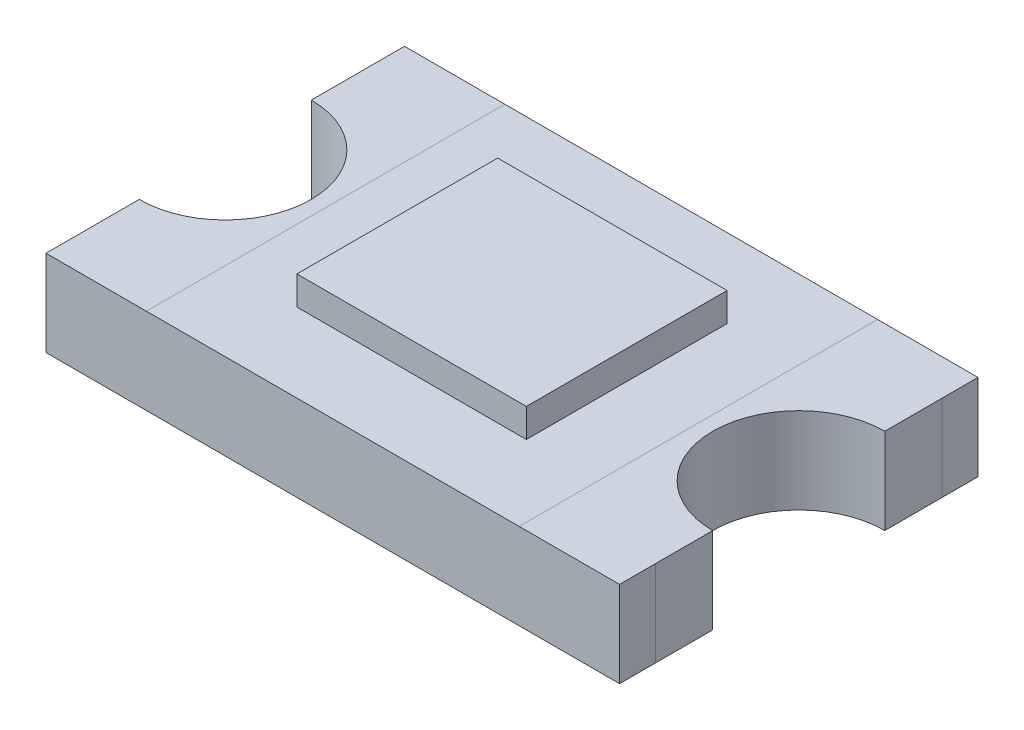
ISO-10303-21;
HEADER;
FILE_DESCRIPTION(('STEP AP214'),'2;1');
FILE_NAME('part.step','',(''),(''),'','','');
FILE_SCHEMA(('AUTOMOTIVE_DESIGN { 1 0 10303 214 1 1 1 1 }'));
ENDSEC;
DATA;
#1=APPLICATION_CONTEXT('core data for automotive mechanical design processes');
#2=APPLICATION_PROTOCOL_DEFINITION('international standard','automotive_design',2000,#1);
#3=PRODUCT_CONTEXT('',#1,'mechanical');
#4=PRODUCT('Part','Part','',(#3));
#5=PRODUCT_RELATED_PRODUCT_CATEGORY('part','',(#4));
#6=PRODUCT_DEFINITION_FORMATION('','',#4);
#7=PRODUCT_DEFINITION_CONTEXT('part definition',#1,'design');
#8=PRODUCT_DEFINITION('design','',#6,#7);
#9=PRODUCT_DEFINITION_SHAPE('','',#8);
#10=(LENGTH_UNIT() NAMED_UNIT(*) SI_UNIT(.MILLI.,.METRE.));
#11=(NAMED_UNIT(*) PLANE_ANGLE_UNIT() SI_UNIT($,.RADIAN.));
#12=(NAMED_UNIT(*) SI_UNIT($,.STERADIAN.) SOLID_ANGLE_UNIT());
#13=UNCERTAINTY_MEASURE_WITH_UNIT(LENGTH_MEASURE(1.E-05),#10,'distance_accuracy_value','');
#14=(GEOMETRIC_REPRESENTATION_CONTEXT(3) GLOBAL_UNCERTAINTY_ASSIGNED_CONTEXT((#13)) GLOBAL_UNIT_ASSIGNED_CONTEXT((#10,
#11,#12)) REPRESENTATION_CONTEXT('',''));
#15=CARTESIAN_POINT('',(0.,0.,0.));
#16=DIRECTION('',(0.,0.,1.));
#17=DIRECTION('',(1.,0.,0.));
#18=AXIS2_PLACEMENT_3D('',#15,#16,#17);
#19=CARTESIAN_POINT('',(1.,0.,0.));
#20=DIRECTION('',(0.,1.,0.));
#21=DIRECTION('',(1.,0.,0.));
#22=AXIS2_PLACEMENT_3D('',#19,#20,#21);
#23=PLANE('',#22);
#24=DIRECTION('',(0.,0.,1.));
#25=VECTOR('',#24,1.);
#26=CARTESIAN_POINT('',(-1.,0.,-0.3));
#27=LINE('',#26,#25);
#28=CARTESIAN_POINT('',(-1.,0.,-0.575));
#29=VERTEX_POINT('',#28);
#30=CARTESIAN_POINT('',(-1.,0.,-0.5));
#31=VERTEX_POINT('',#30);
#32=EDGE_CURVE('P0_E344',#29,#31,#27,.T.);
#33=ORIENTED_EDGE('',*,*,#32,.F.);
#34=DIRECTION('',(1.,0.,0.));
#35=VECTOR('',#34,1.);
#36=CARTESIAN_POINT('',(1.,0.,-0.575));
#37=LINE('',#36,#35);
#38=CARTESIAN_POINT('',(-0.6,0.,-0.575));
#39=VERTEX_POINT('',#38);
#40=EDGE_CURVE('P0_E297',#29,#39,#37,.T.);
#41=ORIENTED_EDGE('',*,*,#40,.T.);
#42=DIRECTION('',(0.,0.,1.));
#43=VECTOR('',#42,1.);
#44=CARTESIAN_POINT('',(-0.6,0.,0.));
#45=LINE('',#44,#43);
#46=CARTESIAN_POINT('',(-0.6,0.,0.575));
#47=VERTEX_POINT('',#46);
#48=EDGE_CURVE('P0_E295',#39,#47,#45,.T.);
#49=ORIENTED_EDGE('',*,*,#48,.T.);
#50=DIRECTION('',(-1.,0.,0.));
#51=VECTOR('',#50,1.);
#52=CARTESIAN_POINT('',(1.,0.,0.575));
#53=LINE('',#52,#51);
#54=CARTESIAN_POINT('',(-1.,0.,0.575));
#55=VERTEX_POINT('',#54);
#56=EDGE_CURVE('P0_E292',#47,#55,#53,.T.);
#57=ORIENTED_EDGE('',*,*,#56,.T.);
#58=DIRECTION('',(0.,0.,1.));
#59=VECTOR('',#58,1.);
#60=CARTESIAN_POINT('',(-1.,0.,0.625));
#61=LINE('',#60,#59);
#62=CARTESIAN_POINT('',(-1.,0.,0.5));
#63=VERTEX_POINT('',#62);
#64=EDGE_CURVE('P0_E377',#63,#55,#61,.T.);
#65=ORIENTED_EDGE('',*,*,#64,.F.);
#66=DIRECTION('',(0.,0.,1.));
#67=VECTOR('',#66,1.);
#68=CARTESIAN_POINT('',(-1.,0.,0.625));
#69=LINE('',#68,#67);
#70=CARTESIAN_POINT('',(-1.,0.,0.3));
#71=VERTEX_POINT('',#70);
#72=EDGE_CURVE('P0_E49',#71,#63,#69,.T.);
#73=ORIENTED_EDGE('',*,*,#72,.F.);
#74=CARTESIAN_POINT('',(-1.,0.,0.));
#75=DIRECTION('',(0.,-1.,0.));
#76=DIRECTION('',(0.,0.,1.));
#77=AXIS2_PLACEMENT_3D('',#74,#75,#76);
#78=CIRCLE('',#77,0.3);
#79=CARTESIAN_POINT('',(-1.,0.,-0.3));
#80=VERTEX_POINT('',#79);
#81=EDGE_CURVE('P0_E348',#80,#71,#78,.T.);
#82=ORIENTED_EDGE('',*,*,#81,.F.);
#83=DIRECTION('',(0.,0.,1.));
#84=VECTOR('',#83,1.);
#85=CARTESIAN_POINT('',(-1.,0.,-0.3));
#86=LINE('',#85,#84);
#87=EDGE_CURVE('P0_E367',#31,#80,#86,.T.);
#88=ORIENTED_EDGE('',*,*,#87,.F.);
#89=EDGE_LOOP('',(#33,#41,#49,#57,#65,#73,#82,#88));
#90=FACE_BOUND('',#89,.T.);
#91=ADVANCED_FACE('P0_F17',(#90),#23,.F.);
#92=CARTESIAN_POINT('',(1.,0.3,0.));
#93=DIRECTION('',(0.,1.,0.));
#94=DIRECTION('',(1.,0.,0.));
#95=AXIS2_PLACEMENT_3D('',#92,#93,#94);
#96=PLANE('',#95);
#97=DIRECTION('',(0.,0.,-1.));
#98=VECTOR('',#97,1.);
#99=CARTESIAN_POINT('',(0.65,0.3,0.));
#100=LINE('',#99,#98);
#101=CARTESIAN_POINT('',(0.65,0.3,0.625));
#102=VERTEX_POINT('',#101);
#103=CARTESIAN_POINT('',(0.65,0.3,-0.625));
#104=VERTEX_POINT('',#103);
#105=EDGE_CURVE('P0_E229',#102,#104,#100,.T.);
#106=ORIENTED_EDGE('',*,*,#105,.F.);
#107=DIRECTION('',(1.,0.,0.));
#108=VECTOR('',#107,1.);
#109=CARTESIAN_POINT('',(-1.,0.3,0.625));
#110=LINE('',#109,#108);
#111=CARTESIAN_POINT('',(1.,0.3,0.625));
#112=VERTEX_POINT('',#111);
#113=EDGE_CURVE('P0_E219',#102,#112,#110,.T.);
#114=ORIENTED_EDGE('',*,*,#113,.T.);
#115=DIRECTION('',(0.,0.,-1.));
#116=VECTOR('',#115,1.);
#117=CARTESIAN_POINT('',(1.,0.3,0.625));
#118=LINE('',#117,#116);
#119=CARTESIAN_POINT('',(1.,0.3,0.5));
#120=VERTEX_POINT('',#119);
#121=EDGE_CURVE('P0_E396',#112,#120,#118,.T.);
#122=ORIENTED_EDGE('',*,*,#121,.T.);
#123=DIRECTION('',(0.,0.,-1.));
#124=VECTOR('',#123,1.);
#125=CARTESIAN_POINT('',(1.,0.3,0.625));
#126=LINE('',#125,#124);
#127=CARTESIAN_POINT('',(1.,0.3,0.3));
#128=VERTEX_POINT('',#127);
#129=EDGE_CURVE('P0_E281',#120,#128,#126,.T.);
#130=ORIENTED_EDGE('',*,*,#129,.T.);
#131=CARTESIAN_POINT('',(1.,0.3,0.));
#132=DIRECTION('',(0.,-1.,0.));
#133=DIRECTION('',(0.,0.,1.));
#134=AXIS2_PLACEMENT_3D('',#131,#132,#133);
#135=CIRCLE('',#134,0.3);
#136=CARTESIAN_POINT('',(1.,0.3,-0.3));
#137=VERTEX_POINT('',#136);
#138=EDGE_CURVE('P0_E25',#128,#137,#135,.T.);
#139=ORIENTED_EDGE('',*,*,#138,.T.);
#140=DIRECTION('',(0.,0.,-1.));
#141=VECTOR('',#140,1.);
#142=CARTESIAN_POINT('',(1.,0.3,-0.3));
#143=LINE('',#142,#141);
#144=CARTESIAN_POINT('',(1.,0.3,-0.5));
#145=VERTEX_POINT('',#144);
#146=EDGE_CURVE('P0_E405',#137,#145,#143,.T.);
#147=ORIENTED_EDGE('',*,*,#146,.T.);
#148=DIRECTION('',(0.,0.,-1.));
#149=VECTOR('',#148,1.);
#150=CARTESIAN_POINT('',(1.,0.3,-0.3));
#151=LINE('',#150,#149);
#152=CARTESIAN_POINT('',(1.,0.3,-0.625));
#153=VERTEX_POINT('',#152);
#154=EDGE_CURVE('P0_E11',#145,#153,#151,.T.);
#155=ORIENTED_EDGE('',*,*,#154,.T.);
#156=DIRECTION('',(-1.,0.,0.));
#157=VECTOR('',#156,1.);
#158=CARTESIAN_POINT('',(-1.,0.3,-0.625));
#159=LINE('',#158,#157);
#160=EDGE_CURVE('P0_E225',#153,#104,#159,.T.);
#161=ORIENTED_EDGE('',*,*,#160,.T.);
#162=EDGE_LOOP('',(#106,#114,#122,#130,#139,#147,#155,#161));
#163=FACE_BOUND('',#162,.T.);
#164=ADVANCED_FACE('P0_F227',(#163),#96,.T.);
#165=CARTESIAN_POINT('',(1.,0.3,-0.3));
#166=DIRECTION('',(-1.,0.,0.));
#167=DIRECTION('',(0.,0.,1.));
#168=AXIS2_PLACEMENT_3D('',#165,#166,#167);
#169=PLANE('',#168);
#170=ORIENTED_EDGE('',*,*,#154,.F.);
#171=DIRECTION('',(0.,-1.,0.));
#172=VECTOR('',#171,1.);
#173=CARTESIAN_POINT('',(1.,0.3,-0.5));
#174=LINE('',#173,#172);
#175=CARTESIAN_POINT('',(1.,0.,-0.5));
#176=VERTEX_POINT('',#175);
#177=EDGE_CURVE('P0_E393',#145,#176,#174,.T.);
#178=ORIENTED_EDGE('',*,*,#177,.T.);
#179=DIRECTION('',(0.,0.,-1.));
#180=VECTOR('',#179,1.);
#181=CARTESIAN_POINT('',(1.,0.,-0.3));
#182=LINE('',#181,#180);
#183=CARTESIAN_POINT('',(1.,0.,-0.575));
#184=VERTEX_POINT('',#183);
#185=EDGE_CURVE('P0_E269',#176,#184,#182,.T.);
#186=ORIENTED_EDGE('',*,*,#185,.T.);
#187=DIRECTION('',(0.,0.,-1.));
#188=VECTOR('',#187,1.);
#189=CARTESIAN_POINT('',(1.,0.,-0.3));
#190=LINE('',#189,#188);
#191=CARTESIAN_POINT('',(1.,0.,-0.625));
#192=VERTEX_POINT('',#191);
#193=EDGE_CURVE('P0_E308',#184,#192,#190,.T.);
#194=ORIENTED_EDGE('',*,*,#193,.T.);
#195=DIRECTION('',(0.,-1.,0.));
#196=VECTOR('',#195,1.);
#197=CARTESIAN_POINT('',(1.,0.3,-0.625));
#198=LINE('',#197,#196);
#199=EDGE_CURVE('P0_E235',#153,#192,#198,.T.);
#200=ORIENTED_EDGE('',*,*,#199,.F.);
#201=EDGE_LOOP('',(#170,#178,#186,#194,#200));
#202=FACE_BOUND('',#201,.T.);
#203=ADVANCED_FACE('P0_F463',(#202),#169,.F.);
#204=CARTESIAN_POINT('',(1.,0.3,0.));
#205=DIRECTION('',(0.,-1.,0.));
#206=DIRECTION('',(0.,0.,-1.));
#207=AXIS2_PLACEMENT_3D('',#204,#205,#206);
#208=CYLINDRICAL_SURFACE('',#207,0.3);
#209=CARTESIAN_POINT('',(1.,0.,0.));
#210=DIRECTION('',(0.,-1.,0.));
#211=DIRECTION('',(0.,0.,1.));
#212=AXIS2_PLACEMENT_3D('',#209,#210,#211);
#213=CIRCLE('',#212,0.3);
#214=CARTESIAN_POINT('',(1.,0.,0.3));
#215=VERTEX_POINT('',#214);
#216=CARTESIAN_POINT('',(1.,0.,-0.3));
#217=VERTEX_POINT('',#216);
#218=EDGE_CURVE('P0_E265',#215,#217,#213,.T.);
#219=ORIENTED_EDGE('',*,*,#218,.T.);
#220=DIRECTION('',(0.,-1.,0.));
#221=VECTOR('',#220,1.);
#222=CARTESIAN_POINT('',(1.,0.3,-0.3));
#223=LINE('',#222,#221);
#224=EDGE_CURVE('P0_E408',#137,#217,#223,.T.);
#225=ORIENTED_EDGE('',*,*,#224,.F.);
#226=ORIENTED_EDGE('',*,*,#138,.F.);
#227=DIRECTION('',(0.,-1.,0.));
#228=VECTOR('',#227,1.);
#229=CARTESIAN_POINT('',(1.,0.3,0.3));
#230=LINE('',#229,#228);
#231=EDGE_CURVE('P0_E125',#128,#215,#230,.T.);
#232=ORIENTED_EDGE('',*,*,#231,.T.);
#233=EDGE_LOOP('',(#219,#225,#226,#232));
#234=FACE_BOUND('',#233,.T.);
#235=ADVANCED_FACE('P0_F469',(#234),#208,.F.);
#236=CARTESIAN_POINT('',(1.,0.3,0.625));
#237=DIRECTION('',(-1.,0.,0.));
#238=DIRECTION('',(0.,0.,1.));
#239=AXIS2_PLACEMENT_3D('',#236,#237,#238);
#240=PLANE('',#239);
#241=ORIENTED_EDGE('',*,*,#129,.F.);
#242=DIRECTION('',(0.,-1.,0.));
#243=VECTOR('',#242,1.);
#244=CARTESIAN_POINT('',(1.,0.3,0.5));
#245=LINE('',#244,#243);
#246=CARTESIAN_POINT('',(1.,0.,0.5));
#247=VERTEX_POINT('',#246);
#248=EDGE_CURVE('P0_E382',#120,#247,#245,.T.);
#249=ORIENTED_EDGE('',*,*,#248,.T.);
#250=DIRECTION('',(0.,0.,-1.));
#251=VECTOR('',#250,1.);
#252=CARTESIAN_POINT('',(1.,0.,0.625));
#253=LINE('',#252,#251);
#254=EDGE_CURVE('P0_E268',#247,#215,#253,.T.);
#255=ORIENTED_EDGE('',*,*,#254,.T.);
#256=ORIENTED_EDGE('',*,*,#231,.F.);
#257=EDGE_LOOP('',(#241,#249,#255,#256));
#258=FACE_BOUND('',#257,.T.);
#259=ADVANCED_FACE('P0_F450',(#258),#240,.F.);
#260=CARTESIAN_POINT('',(-1.,0.3,0.625));
#261=DIRECTION('',(0.,0.,-1.));
#262=DIRECTION('',(0.,-1.,0.));
#263=AXIS2_PLACEMENT_3D('',#260,#261,#262);
#264=PLANE('',#263);
#265=DIRECTION('',(1.,0.,0.));
#266=VECTOR('',#265,1.);
#267=CARTESIAN_POINT('',(-1.,0.,0.625));
#268=LINE('',#267,#266);
#269=CARTESIAN_POINT('',(-1.,0.,0.625));
#270=VERTEX_POINT('',#269);
#271=CARTESIAN_POINT('',(1.,0.,0.625));
#272=VERTEX_POINT('',#271);
#273=EDGE_CURVE('P0_E289',#270,#272,#268,.T.);
#274=ORIENTED_EDGE('',*,*,#273,.T.);
#275=DIRECTION('',(0.,-1.,0.));
#276=VECTOR('',#275,1.);
#277=CARTESIAN_POINT('',(1.,0.3,0.625));
#278=LINE('',#277,#276);
#279=EDGE_CURVE('P0_E400',#112,#272,#278,.T.);
#280=ORIENTED_EDGE('',*,*,#279,.F.);
#281=ORIENTED_EDGE('',*,*,#113,.F.);
#282=DIRECTION('',(1.,0.,0.));
#283=VECTOR('',#282,1.);
#284=CARTESIAN_POINT('',(-1.,0.3,0.625));
#285=LINE('',#284,#283);
#286=CARTESIAN_POINT('',(-0.65,0.3,0.625));
#287=VERTEX_POINT('',#286);
#288=EDGE_CURVE('P0_E251',#287,#102,#285,.T.);
#289=ORIENTED_EDGE('',*,*,#288,.F.);
#290=DIRECTION('',(1.,0.,0.));
#291=VECTOR('',#290,1.);
#292=CARTESIAN_POINT('',(-1.,0.3,0.625));
#293=LINE('',#292,#291);
#294=CARTESIAN_POINT('',(-1.,0.3,0.625));
#295=VERTEX_POINT('',#294);
#296=EDGE_CURVE('P0_E270',#295,#287,#293,.T.);
#297=ORIENTED_EDGE('',*,*,#296,.F.);
#298=DIRECTION('',(0.,-1.,0.));
#299=VECTOR('',#298,1.);
#300=CARTESIAN_POINT('',(-1.,0.3,0.625));
#301=LINE('',#300,#299);
#302=EDGE_CURVE('P0_E376',#295,#270,#301,.T.);
#303=ORIENTED_EDGE('',*,*,#302,.T.);
#304=EDGE_LOOP('',(#274,#280,#281,#289,#297,#303));
#305=FACE_BOUND('',#304,.T.);
#306=ADVANCED_FACE('P0_F452',(#305),#264,.F.);
#307=CARTESIAN_POINT('',(-1.,0.3,0.625));
#308=DIRECTION('',(1.,0.,0.));
#309=DIRECTION('',(0.,1.,0.));
#310=AXIS2_PLACEMENT_3D('',#307,#308,#309);
#311=PLANE('',#310);
#312=ORIENTED_EDGE('',*,*,#72,.T.);
#313=DIRECTION('',(0.,1.,0.));
#314=VECTOR('',#313,1.);
#315=CARTESIAN_POINT('',(-1.,0.3,0.5));
#316=LINE('',#315,#314);
#317=CARTESIAN_POINT('',(-1.,0.3,0.5));
#318=VERTEX_POINT('',#317);
#319=EDGE_CURVE('P0_E362',#63,#318,#316,.T.);
#320=ORIENTED_EDGE('',*,*,#319,.T.);
#321=DIRECTION('',(0.,0.,1.));
#322=VECTOR('',#321,1.);
#323=CARTESIAN_POINT('',(-1.,0.3,0.625));
#324=LINE('',#323,#322);
#325=CARTESIAN_POINT('',(-1.,0.3,0.3));
#326=VERTEX_POINT('',#325);
#327=EDGE_CURVE('P0_E285',#326,#318,#324,.T.);
#328=ORIENTED_EDGE('',*,*,#327,.F.);
#329=DIRECTION('',(0.,-1.,0.));
#330=VECTOR('',#329,1.);
#331=CARTESIAN_POINT('',(-1.,0.3,0.3));
#332=LINE('',#331,#330);
#333=EDGE_CURVE('P0_E263',#326,#71,#332,.T.);
#334=ORIENTED_EDGE('',*,*,#333,.T.);
#335=EDGE_LOOP('',(#312,#320,#328,#334));
#336=FACE_BOUND('',#335,.T.);
#337=ADVANCED_FACE('P0_F706',(#336),#311,.F.);
#338=CARTESIAN_POINT('',(-1.,0.3,0.));
#339=DIRECTION('',(0.,-1.,0.));
#340=DIRECTION('',(0.,0.,-1.));
#341=AXIS2_PLACEMENT_3D('',#338,#339,#340);
#342=CYLINDRICAL_SURFACE('',#341,0.3);
#343=ORIENTED_EDGE('',*,*,#81,.T.);
#344=ORIENTED_EDGE('',*,*,#333,.F.);
#345=CARTESIAN_POINT('',(-1.,0.3,0.));
#346=DIRECTION('',(0.,-1.,0.));
#347=DIRECTION('',(0.,0.,1.));
#348=AXIS2_PLACEMENT_3D('',#345,#346,#347);
#349=CIRCLE('',#348,0.3);
#350=CARTESIAN_POINT('',(-1.,0.3,-0.3));
#351=VERTEX_POINT('',#350);
#352=EDGE_CURVE('P0_E280',#351,#326,#349,.T.);
#353=ORIENTED_EDGE('',*,*,#352,.F.);
#354=DIRECTION('',(0.,-1.,0.));
#355=VECTOR('',#354,1.);
#356=CARTESIAN_POINT('',(-1.,0.3,-0.3));
#357=LINE('',#356,#355);
#358=EDGE_CURVE('P0_E371',#351,#80,#357,.T.);
#359=ORIENTED_EDGE('',*,*,#358,.T.);
#360=EDGE_LOOP('',(#343,#344,#353,#359));
#361=FACE_BOUND('',#360,.T.);
#362=ADVANCED_FACE('P0_F678',(#361),#342,.F.);
#363=CARTESIAN_POINT('',(-1.,0.3,-0.3));
#364=DIRECTION('',(1.,0.,0.));
#365=DIRECTION('',(0.,1.,0.));
#366=AXIS2_PLACEMENT_3D('',#363,#364,#365);
#367=PLANE('',#366);
#368=ORIENTED_EDGE('',*,*,#32,.T.);
#369=DIRECTION('',(0.,1.,0.));
#370=VECTOR('',#369,1.);
#371=CARTESIAN_POINT('',(-1.,0.3,-0.5));
#372=LINE('',#371,#370);
#373=CARTESIAN_POINT('',(-1.,0.3,-0.5));
#374=VERTEX_POINT('',#373);
#375=EDGE_CURVE('P0_E363',#31,#374,#372,.T.);
#376=ORIENTED_EDGE('',*,*,#375,.T.);
#377=DIRECTION('',(0.,0.,1.));
#378=VECTOR('',#377,1.);
#379=CARTESIAN_POINT('',(-1.,0.3,-0.3));
#380=LINE('',#379,#378);
#381=CARTESIAN_POINT('',(-1.,0.3,-0.625));
#382=VERTEX_POINT('',#381);
#383=EDGE_CURVE('P0_E275',#382,#374,#380,.T.);
#384=ORIENTED_EDGE('',*,*,#383,.F.);
#385=DIRECTION('',(0.,-1.,0.));
#386=VECTOR('',#385,1.);
#387=CARTESIAN_POINT('',(-1.,0.3,-0.625));
#388=LINE('',#387,#386);
#389=CARTESIAN_POINT('',(-1.,0.,-0.625));
#390=VERTEX_POINT('',#389);
#391=EDGE_CURVE('P0_E236',#382,#390,#388,.T.);
#392=ORIENTED_EDGE('',*,*,#391,.T.);
#393=DIRECTION('',(0.,0.,1.));
#394=VECTOR('',#393,1.);
#395=CARTESIAN_POINT('',(-1.,0.,-0.3));
#396=LINE('',#395,#394);
#397=EDGE_CURVE('P0_E301',#390,#29,#396,.T.);
#398=ORIENTED_EDGE('',*,*,#397,.T.);
#399=EDGE_LOOP('',(#368,#376,#384,#392,#398));
#400=FACE_BOUND('',#399,.T.);
#401=ADVANCED_FACE('P0_F490',(#400),#367,.F.);
#402=CARTESIAN_POINT('',(-1.,0.3,-0.625));
#403=DIRECTION('',(0.,0.,1.));
#404=DIRECTION('',(1.,0.,0.));
#405=AXIS2_PLACEMENT_3D('',#402,#403,#404);
#406=PLANE('',#405);
#407=DIRECTION('',(-1.,0.,0.));
#408=VECTOR('',#407,1.);
#409=CARTESIAN_POINT('',(-1.,0.,-0.625));
#410=LINE('',#409,#408);
#411=EDGE_CURVE('P0_E305',#192,#390,#410,.T.);
#412=ORIENTED_EDGE('',*,*,#411,.T.);
#413=ORIENTED_EDGE('',*,*,#391,.F.);
#414=DIRECTION('',(-1.,0.,0.));
#415=VECTOR('',#414,1.);
#416=CARTESIAN_POINT('',(-1.,0.3,-0.625));
#417=LINE('',#416,#415);
#418=CARTESIAN_POINT('',(-0.65,0.3,-0.625));
#419=VERTEX_POINT('',#418);
#420=EDGE_CURVE('P0_E243',#419,#382,#417,.T.);
#421=ORIENTED_EDGE('',*,*,#420,.F.);
#422=DIRECTION('',(-1.,0.,0.));
#423=VECTOR('',#422,1.);
#424=CARTESIAN_POINT('',(-1.,0.3,-0.625));
#425=LINE('',#424,#423);
#426=EDGE_CURVE('P0_E239',#104,#419,#425,.T.);
#427=ORIENTED_EDGE('',*,*,#426,.F.);
#428=ORIENTED_EDGE('',*,*,#160,.F.);
#429=ORIENTED_EDGE('',*,*,#199,.T.);
#430=EDGE_LOOP('',(#412,#413,#421,#427,#428,#429));
#431=FACE_BOUND('',#430,.T.);
#432=ADVANCED_FACE('P0_F241',(#431),#406,.F.);
#433=CARTESIAN_POINT('',(1.,0.,0.));
#434=DIRECTION('',(0.,1.,0.));
#435=DIRECTION('',(1.,0.,0.));
#436=AXIS2_PLACEMENT_3D('',#433,#434,#435);
#437=PLANE('',#436);
#438=DIRECTION('',(0.,0.,-1.));
#439=VECTOR('',#438,1.);
#440=CARTESIAN_POINT('',(1.,0.,0.625));
#441=LINE('',#440,#439);
#442=CARTESIAN_POINT('',(1.,0.,0.575));
#443=VERTEX_POINT('',#442);
#444=EDGE_CURVE('P0_E258',#443,#247,#441,.T.);
#445=ORIENTED_EDGE('',*,*,#444,.F.);
#446=DIRECTION('',(-1.,0.,0.));
#447=VECTOR('',#446,1.);
#448=CARTESIAN_POINT('',(1.,0.,0.575));
#449=LINE('',#448,#447);
#450=CARTESIAN_POINT('',(0.6,0.,0.575));
#451=VERTEX_POINT('',#450);
#452=EDGE_CURVE('P0_E288',#443,#451,#449,.T.);
#453=ORIENTED_EDGE('',*,*,#452,.T.);
#454=DIRECTION('',(0.,0.,-1.));
#455=VECTOR('',#454,1.);
#456=CARTESIAN_POINT('',(0.6,0.,0.));
#457=LINE('',#456,#455);
#458=CARTESIAN_POINT('',(0.6,0.,-0.575));
#459=VERTEX_POINT('',#458);
#460=EDGE_CURVE('P0_E316',#451,#459,#457,.T.);
#461=ORIENTED_EDGE('',*,*,#460,.T.);
#462=DIRECTION('',(1.,0.,0.));
#463=VECTOR('',#462,1.);
#464=CARTESIAN_POINT('',(1.,0.,-0.575));
#465=LINE('',#464,#463);
#466=EDGE_CURVE('P0_E312',#459,#184,#465,.T.);
#467=ORIENTED_EDGE('',*,*,#466,.T.);
#468=ORIENTED_EDGE('',*,*,#185,.F.);
#469=DIRECTION('',(0.,0.,-1.));
#470=VECTOR('',#469,1.);
#471=CARTESIAN_POINT('',(1.,0.,-0.3));
#472=LINE('',#471,#470);
#473=EDGE_CURVE('P0_E422',#217,#176,#472,.T.);
#474=ORIENTED_EDGE('',*,*,#473,.F.);
#475=ORIENTED_EDGE('',*,*,#218,.F.);
#476=ORIENTED_EDGE('',*,*,#254,.F.);
#477=EDGE_LOOP('',(#445,#453,#461,#467,#468,#474,#475,#476));
#478=FACE_BOUND('',#477,.T.);
#479=ADVANCED_FACE('P0_F458',(#478),#437,.F.);
#480=CARTESIAN_POINT('',(1.,0.,0.));
#481=DIRECTION('',(0.,1.,0.));
#482=DIRECTION('',(1.,0.,0.));
#483=AXIS2_PLACEMENT_3D('',#480,#481,#482);
#484=PLANE('',#483);
#485=DIRECTION('',(0.,0.,1.));
#486=VECTOR('',#485,1.);
#487=CARTESIAN_POINT('',(-0.0375,0.,0.));
#488=LINE('',#487,#486);
#489=CARTESIAN_POINT('',(-0.0375,0.,0.0625));
#490=VERTEX_POINT('',#489);
#491=CARTESIAN_POINT('',(-0.0375,0.,0.525));
#492=VERTEX_POINT('',#491);
#493=EDGE_CURVE('P0_E322',#490,#492,#488,.T.);
#494=ORIENTED_EDGE('',*,*,#493,.T.);
#495=DIRECTION('',(-1.,0.,0.));
#496=VECTOR('',#495,1.);
#497=CARTESIAN_POINT('',(1.,0.,0.525));
#498=LINE('',#497,#496);
#499=CARTESIAN_POINT('',(-0.1625,0.,0.525));
#500=VERTEX_POINT('',#499);
#501=EDGE_CURVE('P0_E319',#492,#500,#498,.T.);
#502=ORIENTED_EDGE('',*,*,#501,.T.);
#503=DIRECTION('',(0.,0.,-1.));
#504=VECTOR('',#503,1.);
#505=CARTESIAN_POINT('',(-0.1625,0.,0.));
#506=LINE('',#505,#504);
#507=CARTESIAN_POINT('',(-0.1625,0.,-0.525));
#508=VERTEX_POINT('',#507);
#509=EDGE_CURVE('P0_E135',#500,#508,#506,.T.);
#510=ORIENTED_EDGE('',*,*,#509,.T.);
#511=DIRECTION('',(1.,0.,0.));
#512=VECTOR('',#511,1.);
#513=CARTESIAN_POINT('',(1.,0.,-0.525));
#514=LINE('',#513,#512);
#515=CARTESIAN_POINT('',(-0.0375,0.,-0.525));
#516=VERTEX_POINT('',#515);
#517=EDGE_CURVE('P0_E335',#508,#516,#514,.T.);
#518=ORIENTED_EDGE('',*,*,#517,.T.);
#519=DIRECTION('',(0.,0.,1.));
#520=VECTOR('',#519,1.);
#521=CARTESIAN_POINT('',(-0.0375,0.,0.));
#522=LINE('',#521,#520);
#523=CARTESIAN_POINT('',(-0.0375,0.,-0.0625));
#524=VERTEX_POINT('',#523);
#525=EDGE_CURVE('P0_E332',#516,#524,#522,.T.);
#526=ORIENTED_EDGE('',*,*,#525,.T.);
#527=DIRECTION('',(1.,0.,0.));
#528=VECTOR('',#527,1.);
#529=CARTESIAN_POINT('',(1.,0.,-0.0625));
#530=LINE('',#529,#528);
#531=CARTESIAN_POINT('',(0.1625,0.,-0.0625));
#532=VERTEX_POINT('',#531);
#533=EDGE_CURVE('P0_E329',#524,#532,#530,.T.);
#534=ORIENTED_EDGE('',*,*,#533,.T.);
#535=DIRECTION('',(0.,0.,1.));
#536=VECTOR('',#535,1.);
#537=CARTESIAN_POINT('',(0.1625,0.,0.));
#538=LINE('',#537,#536);
#539=CARTESIAN_POINT('',(0.1625,0.,0.0625));
#540=VERTEX_POINT('',#539);
#541=EDGE_CURVE('P0_E326',#532,#540,#538,.T.);
#542=ORIENTED_EDGE('',*,*,#541,.T.);
#543=DIRECTION('',(-1.,0.,0.));
#544=VECTOR('',#543,1.);
#545=CARTESIAN_POINT('',(1.,0.,0.0625));
#546=LINE('',#545,#544);
#547=EDGE_CURVE('P0_E325',#540,#490,#546,.T.);
#548=ORIENTED_EDGE('',*,*,#547,.T.);
#549=EDGE_LOOP('',(#494,#502,#510,#518,#526,#534,#542,#548));
#550=FACE_BOUND('',#549,.T.);
#551=ADVANCED_FACE('P0_F734',(#550),#484,.F.);
#552=CARTESIAN_POINT('',(1.,0.,0.));
#553=DIRECTION('',(0.,1.,0.));
#554=DIRECTION('',(1.,0.,0.));
#555=AXIS2_PLACEMENT_3D('',#552,#553,#554);
#556=PLANE('',#555);
#557=ORIENTED_EDGE('',*,*,#501,.F.);
#558=ORIENTED_EDGE('',*,*,#493,.F.);
#559=ORIENTED_EDGE('',*,*,#547,.F.);
#560=ORIENTED_EDGE('',*,*,#541,.F.);
#561=ORIENTED_EDGE('',*,*,#533,.F.);
#562=ORIENTED_EDGE('',*,*,#525,.F.);
#563=ORIENTED_EDGE('',*,*,#517,.F.);
#564=ORIENTED_EDGE('',*,*,#509,.F.);
#565=EDGE_LOOP('',(#557,#558,#559,#560,#561,#562,#563,#564));
#566=FACE_BOUND('',#565,.T.);
#567=ORIENTED_EDGE('',*,*,#452,.F.);
#568=DIRECTION('',(0.,0.,-1.));
#569=VECTOR('',#568,1.);
#570=CARTESIAN_POINT('',(1.,0.,0.625));
#571=LINE('',#570,#569);
#572=EDGE_CURVE('P0_E401',#272,#443,#571,.T.);
#573=ORIENTED_EDGE('',*,*,#572,.F.);
#574=ORIENTED_EDGE('',*,*,#273,.F.);
#575=DIRECTION('',(0.,0.,1.));
#576=VECTOR('',#575,1.);
#577=CARTESIAN_POINT('',(-1.,0.,0.625));
#578=LINE('',#577,#576);
#579=EDGE_CURVE('P0_E372',#55,#270,#578,.T.);
#580=ORIENTED_EDGE('',*,*,#579,.F.);
#581=ORIENTED_EDGE('',*,*,#56,.F.);
#582=ORIENTED_EDGE('',*,*,#48,.F.);
#583=ORIENTED_EDGE('',*,*,#40,.F.);
#584=ORIENTED_EDGE('',*,*,#397,.F.);
#585=ORIENTED_EDGE('',*,*,#411,.F.);
#586=ORIENTED_EDGE('',*,*,#193,.F.);
#587=ORIENTED_EDGE('',*,*,#466,.F.);
#588=ORIENTED_EDGE('',*,*,#460,.F.);
#589=EDGE_LOOP('',(#567,#573,#574,#580,#581,#582,#583,#584,#585,#586,#587,#588));
#590=FACE_BOUND('',#589,.T.);
#591=ADVANCED_FACE('P0_F456',(#566,#590),#556,.F.);
#592=CARTESIAN_POINT('',(1.,0.3,0.));
#593=DIRECTION('',(0.,1.,0.));
#594=DIRECTION('',(1.,0.,0.));
#595=AXIS2_PLACEMENT_3D('',#592,#593,#594);
#596=PLANE('',#595);
#597=ORIENTED_EDGE('',*,*,#296,.T.);
#598=DIRECTION('',(0.,0.,-1.));
#599=VECTOR('',#598,1.);
#600=CARTESIAN_POINT('',(-0.65,0.3,0.));
#601=LINE('',#600,#599);
#602=EDGE_CURVE('P0_E248',#287,#419,#601,.T.);
#603=ORIENTED_EDGE('',*,*,#602,.T.);
#604=ORIENTED_EDGE('',*,*,#420,.T.);
#605=ORIENTED_EDGE('',*,*,#383,.T.);
#606=DIRECTION('',(0.,0.,1.));
#607=VECTOR('',#606,1.);
#608=CARTESIAN_POINT('',(-1.,0.3,-0.3));
#609=LINE('',#608,#607);
#610=EDGE_CURVE('P0_E386',#374,#351,#609,.T.);
#611=ORIENTED_EDGE('',*,*,#610,.T.);
#612=ORIENTED_EDGE('',*,*,#352,.T.);
#613=ORIENTED_EDGE('',*,*,#327,.T.);
#614=DIRECTION('',(0.,0.,1.));
#615=VECTOR('',#614,1.);
#616=CARTESIAN_POINT('',(-1.,0.3,0.625));
#617=LINE('',#616,#615);
#618=EDGE_CURVE('P0_E378',#318,#295,#617,.T.);
#619=ORIENTED_EDGE('',*,*,#618,.T.);
#620=EDGE_LOOP('',(#597,#603,#604,#605,#611,#612,#613,#619));
#621=FACE_BOUND('',#620,.T.);
#622=ADVANCED_FACE('P0_F733',(#621),#596,.T.);
#623=CARTESIAN_POINT('',(1.,0.3,0.));
#624=DIRECTION('',(0.,1.,0.));
#625=DIRECTION('',(1.,0.,0.));
#626=AXIS2_PLACEMENT_3D('',#623,#624,#625);
#627=PLANE('',#626);
#628=ORIENTED_EDGE('',*,*,#288,.T.);
#629=ORIENTED_EDGE('',*,*,#105,.T.);
#630=ORIENTED_EDGE('',*,*,#426,.T.);
#631=ORIENTED_EDGE('',*,*,#602,.F.);
#632=EDGE_LOOP('',(#628,#629,#630,#631));
#633=FACE_BOUND('',#632,.T.);
#634=ADVANCED_FACE('P0_F250',(#633),#627,.T.);
#635=CARTESIAN_POINT('',(1.,0.3,0.625));
#636=DIRECTION('',(-1.,0.,0.));
#637=DIRECTION('',(0.,0.,1.));
#638=AXIS2_PLACEMENT_3D('',#635,#636,#637);
#639=PLANE('',#638);
#640=ORIENTED_EDGE('',*,*,#248,.F.);
#641=ORIENTED_EDGE('',*,*,#121,.F.);
#642=ORIENTED_EDGE('',*,*,#279,.T.);
#643=ORIENTED_EDGE('',*,*,#572,.T.);
#644=ORIENTED_EDGE('',*,*,#444,.T.);
#645=EDGE_LOOP('',(#640,#641,#642,#643,#644));
#646=FACE_BOUND('',#645,.T.);
#647=ADVANCED_FACE('P0_F445',(#646),#639,.F.);
#648=CARTESIAN_POINT('',(-1.,0.3,0.625));
#649=DIRECTION('',(1.,0.,0.));
#650=DIRECTION('',(0.,1.,0.));
#651=AXIS2_PLACEMENT_3D('',#648,#649,#650);
#652=PLANE('',#651);
#653=ORIENTED_EDGE('',*,*,#319,.F.);
#654=ORIENTED_EDGE('',*,*,#64,.T.);
#655=ORIENTED_EDGE('',*,*,#579,.T.);
#656=ORIENTED_EDGE('',*,*,#302,.F.);
#657=ORIENTED_EDGE('',*,*,#618,.F.);
#658=EDGE_LOOP('',(#653,#654,#655,#656,#657));
#659=FACE_BOUND('',#658,.T.);
#660=ADVANCED_FACE('P0_F495',(#659),#652,.F.);
#661=CARTESIAN_POINT('',(1.,0.3,-0.3));
#662=DIRECTION('',(-1.,0.,0.));
#663=DIRECTION('',(0.,0.,1.));
#664=AXIS2_PLACEMENT_3D('',#661,#662,#663);
#665=PLANE('',#664);
#666=ORIENTED_EDGE('',*,*,#177,.F.);
#667=ORIENTED_EDGE('',*,*,#146,.F.);
#668=ORIENTED_EDGE('',*,*,#224,.T.);
#669=ORIENTED_EDGE('',*,*,#473,.T.);
#670=EDGE_LOOP('',(#666,#667,#668,#669));
#671=FACE_BOUND('',#670,.T.);
#672=ADVANCED_FACE('P0_F467',(#671),#665,.F.);
#673=CARTESIAN_POINT('',(-1.,0.3,-0.3));
#674=DIRECTION('',(1.,0.,0.));
#675=DIRECTION('',(0.,1.,0.));
#676=AXIS2_PLACEMENT_3D('',#673,#674,#675);
#677=PLANE('',#676);
#678=ORIENTED_EDGE('',*,*,#375,.F.);
#679=ORIENTED_EDGE('',*,*,#87,.T.);
#680=ORIENTED_EDGE('',*,*,#358,.F.);
#681=ORIENTED_EDGE('',*,*,#610,.F.);
#682=EDGE_LOOP('',(#678,#679,#680,#681));
#683=FACE_BOUND('',#682,.T.);
#684=ADVANCED_FACE('P0_F691',(#683),#677,.F.);
#685=CLOSED_SHELL('',(#91,#164,#203,#235,#259,#306,#337,#362,#401,#432,#479,#551,#591,#622,#634,
#647,#660,#672,#684));
#686=MANIFOLD_SOLID_BREP('P0_B1',#685);
#687=CARTESIAN_POINT('',(0.,0.3,0.));
#688=DIRECTION('',(0.,-1.,0.));
#689=DIRECTION('',(0.,0.,-1.));
#690=AXIS2_PLACEMENT_3D('',#687,#688,#689);
#691=PLANE('',#690);
#692=DIRECTION('',(0.,0.,-1.));
#693=VECTOR('',#692,1.);
#694=CARTESIAN_POINT('',(0.4,0.3,0.35));
#695=LINE('',#694,#693);
#696=CARTESIAN_POINT('',(0.4,0.3,0.35));
#697=VERTEX_POINT('',#696);
#698=CARTESIAN_POINT('',(0.4,0.3,-0.35));
#699=VERTEX_POINT('',#698);
#700=EDGE_CURVE('P1_E79',#697,#699,#695,.T.);
#701=ORIENTED_EDGE('',*,*,#700,.F.);
#702=DIRECTION('',(1.,0.,0.));
#703=VECTOR('',#702,1.);
#704=CARTESIAN_POINT('',(-0.4,0.3,0.35));
#705=LINE('',#704,#703);
#706=CARTESIAN_POINT('',(-0.4,0.3,0.35));
#707=VERTEX_POINT('',#706);
#708=EDGE_CURVE('P1_E25',#707,#697,#705,.T.);
#709=ORIENTED_EDGE('',*,*,#708,.F.);
#710=DIRECTION('',(0.,0.,1.));
#711=VECTOR('',#710,1.);
#712=CARTESIAN_POINT('',(-0.4,0.3,0.35));
#713=LINE('',#712,#711);
#714=CARTESIAN_POINT('',(-0.4,0.3,-0.35));
#715=VERTEX_POINT('',#714);
#716=EDGE_CURVE('P1_E106',#715,#707,#713,.T.);
#717=ORIENTED_EDGE('',*,*,#716,.F.);
#718=DIRECTION('',(-1.,0.,0.));
#719=VECTOR('',#718,1.);
#720=CARTESIAN_POINT('',(-0.4,0.3,-0.35));
#721=LINE('',#720,#719);
#722=EDGE_CURVE('P1_E83',#699,#715,#721,.T.);
#723=ORIENTED_EDGE('',*,*,#722,.F.);
#724=EDGE_LOOP('',(#701,#709,#717,#723));
#725=FACE_BOUND('',#724,.T.);
#726=ADVANCED_FACE('P1_F17',(#725),#691,.T.);
#727=CARTESIAN_POINT('',(0.,0.4,0.));
#728=DIRECTION('',(0.,-1.,0.));
#729=DIRECTION('',(0.,0.,-1.));
#730=AXIS2_PLACEMENT_3D('',#727,#728,#729);
#731=PLANE('',#730);
#732=DIRECTION('',(0.,0.,-1.));
#733=VECTOR('',#732,1.);
#734=CARTESIAN_POINT('',(0.4,0.4,0.35));
#735=LINE('',#734,#733);
#736=CARTESIAN_POINT('',(0.4,0.4,0.35));
#737=VERTEX_POINT('',#736);
#738=CARTESIAN_POINT('',(0.4,0.4,-0.35));
#739=VERTEX_POINT('',#738);
#740=EDGE_CURVE('P1_E81',#737,#739,#735,.T.);
#741=ORIENTED_EDGE('',*,*,#740,.T.);
#742=DIRECTION('',(-1.,0.,0.));
#743=VECTOR('',#742,1.);
#744=CARTESIAN_POINT('',(-0.4,0.4,-0.35));
#745=LINE('',#744,#743);
#746=CARTESIAN_POINT('',(-0.4,0.4,-0.35));
#747=VERTEX_POINT('',#746);
#748=EDGE_CURVE('P1_E101',#739,#747,#745,.T.);
#749=ORIENTED_EDGE('',*,*,#748,.T.);
#750=DIRECTION('',(0.,0.,1.));
#751=VECTOR('',#750,1.);
#752=CARTESIAN_POINT('',(-0.4,0.4,0.35));
#753=LINE('',#752,#751);
#754=CARTESIAN_POINT('',(-0.4,0.4,0.35));
#755=VERTEX_POINT('',#754);
#756=EDGE_CURVE('P1_E74',#747,#755,#753,.T.);
#757=ORIENTED_EDGE('',*,*,#756,.T.);
#758=DIRECTION('',(1.,0.,0.));
#759=VECTOR('',#758,1.);
#760=CARTESIAN_POINT('',(-0.4,0.4,0.35));
#761=LINE('',#760,#759);
#762=EDGE_CURVE('P1_E11',#755,#737,#761,.T.);
#763=ORIENTED_EDGE('',*,*,#762,.T.);
#764=EDGE_LOOP('',(#741,#749,#757,#763));
#765=FACE_BOUND('',#764,.T.);
#766=ADVANCED_FACE('P1_F117',(#765),#731,.F.);
#767=CARTESIAN_POINT('',(-0.4,0.4,0.35));
#768=DIRECTION('',(0.,0.,-1.));
#769=DIRECTION('',(0.,-1.,0.));
#770=AXIS2_PLACEMENT_3D('',#767,#768,#769);
#771=PLANE('',#770);
#772=ORIENTED_EDGE('',*,*,#708,.T.);
#773=DIRECTION('',(0.,-1.,0.));
#774=VECTOR('',#773,1.);
#775=CARTESIAN_POINT('',(0.4,0.4,0.35));
#776=LINE('',#775,#774);
#777=EDGE_CURVE('P1_E68',#737,#697,#776,.T.);
#778=ORIENTED_EDGE('',*,*,#777,.F.);
#779=ORIENTED_EDGE('',*,*,#762,.F.);
#780=DIRECTION('',(0.,-1.,0.));
#781=VECTOR('',#780,1.);
#782=CARTESIAN_POINT('',(-0.4,0.4,0.35));
#783=LINE('',#782,#781);
#784=EDGE_CURVE('P1_E71',#755,#707,#783,.T.);
#785=ORIENTED_EDGE('',*,*,#784,.T.);
#786=EDGE_LOOP('',(#772,#778,#779,#785));
#787=FACE_BOUND('',#786,.T.);
#788=ADVANCED_FACE('P1_F67',(#787),#771,.F.);
#789=CARTESIAN_POINT('',(-0.4,0.4,0.35));
#790=DIRECTION('',(1.,0.,0.));
#791=DIRECTION('',(0.,1.,0.));
#792=AXIS2_PLACEMENT_3D('',#789,#790,#791);
#793=PLANE('',#792);
#794=ORIENTED_EDGE('',*,*,#716,.T.);
#795=ORIENTED_EDGE('',*,*,#784,.F.);
#796=ORIENTED_EDGE('',*,*,#756,.F.);
#797=DIRECTION('',(0.,-1.,0.));
#798=VECTOR('',#797,1.);
#799=CARTESIAN_POINT('',(-0.4,0.4,-0.35));
#800=LINE('',#799,#798);
#801=EDGE_CURVE('P1_E98',#747,#715,#800,.T.);
#802=ORIENTED_EDGE('',*,*,#801,.T.);
#803=EDGE_LOOP('',(#794,#795,#796,#802));
#804=FACE_BOUND('',#803,.T.);
#805=ADVANCED_FACE('P1_F120',(#804),#793,.F.);
#806=CARTESIAN_POINT('',(-0.4,0.4,-0.35));
#807=DIRECTION('',(0.,0.,1.));
#808=DIRECTION('',(1.,0.,0.));
#809=AXIS2_PLACEMENT_3D('',#806,#807,#808);
#810=PLANE('',#809);
#811=ORIENTED_EDGE('',*,*,#722,.T.);
#812=ORIENTED_EDGE('',*,*,#801,.F.);
#813=ORIENTED_EDGE('',*,*,#748,.F.);
#814=DIRECTION('',(0.,-1.,0.));
#815=VECTOR('',#814,1.);
#816=CARTESIAN_POINT('',(0.4,0.4,-0.35));
#817=LINE('',#816,#815);
#818=EDGE_CURVE('P1_E88',#739,#699,#817,.T.);
#819=ORIENTED_EDGE('',*,*,#818,.T.);
#820=EDGE_LOOP('',(#811,#812,#813,#819));
#821=FACE_BOUND('',#820,.T.);
#822=ADVANCED_FACE('P1_F122',(#821),#810,.F.);
#823=CARTESIAN_POINT('',(0.4,0.4,0.35));
#824=DIRECTION('',(-1.,0.,0.));
#825=DIRECTION('',(0.,0.,1.));
#826=AXIS2_PLACEMENT_3D('',#823,#824,#825);
#827=PLANE('',#826);
#828=ORIENTED_EDGE('',*,*,#700,.T.);
#829=ORIENTED_EDGE('',*,*,#818,.F.);
#830=ORIENTED_EDGE('',*,*,#740,.F.);
#831=ORIENTED_EDGE('',*,*,#777,.T.);
#832=EDGE_LOOP('',(#828,#829,#830,#831));
#833=FACE_BOUND('',#832,.T.);
#834=ADVANCED_FACE('P1_F77',(#833),#827,.F.);
#835=CLOSED_SHELL('',(#726,#766,#788,#805,#822,#834));
#836=MANIFOLD_SOLID_BREP('P1_B1',#835);
#837=ADVANCED_BREP_SHAPE_REPRESENTATION('',(#18,#686,#836),#14);
#838=SHAPE_DEFINITION_REPRESENTATION(#9,#837);
ENDSEC;
END-ISO-10303-21;
